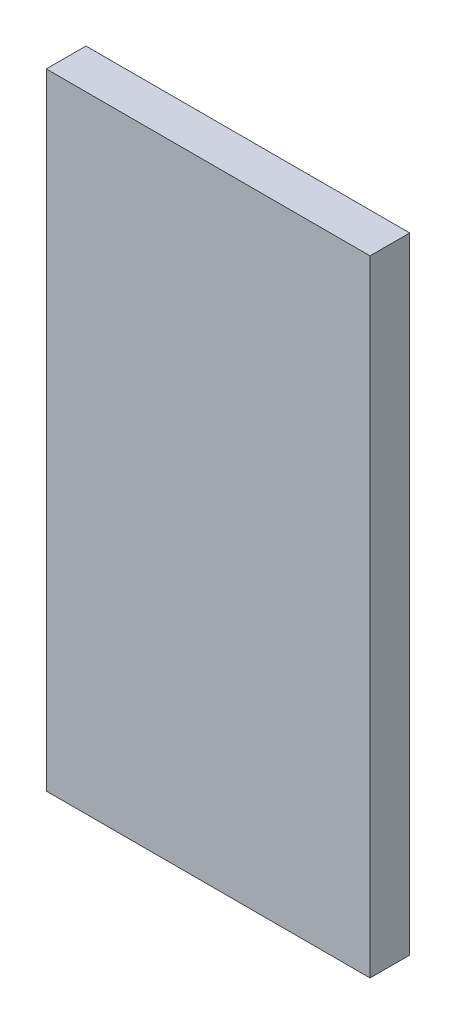
ISO-10303-21;
HEADER;
FILE_DESCRIPTION(('STEP AP214'),'2;1');
FILE_NAME('part.step','',(''),(''),'','','');
FILE_SCHEMA(('AUTOMOTIVE_DESIGN { 1 0 10303 214 1 1 1 1 }'));
ENDSEC;
DATA;
#1=APPLICATION_CONTEXT('core data for automotive mechanical design processes');
#2=APPLICATION_PROTOCOL_DEFINITION('international standard','automotive_design',2000,#1);
#3=PRODUCT_CONTEXT('',#1,'mechanical');
#4=PRODUCT('Part','Part','',(#3));
#5=PRODUCT_RELATED_PRODUCT_CATEGORY('part','',(#4));
#6=PRODUCT_DEFINITION_FORMATION('','',#4);
#7=PRODUCT_DEFINITION_CONTEXT('part definition',#1,'design');
#8=PRODUCT_DEFINITION('design','',#6,#7);
#9=PRODUCT_DEFINITION_SHAPE('','',#8);
#10=(LENGTH_UNIT() NAMED_UNIT(*) SI_UNIT(.MILLI.,.METRE.));
#11=(NAMED_UNIT(*) PLANE_ANGLE_UNIT() SI_UNIT($,.RADIAN.));
#12=(NAMED_UNIT(*) SI_UNIT($,.STERADIAN.) SOLID_ANGLE_UNIT());
#13=UNCERTAINTY_MEASURE_WITH_UNIT(LENGTH_MEASURE(1.E-05),#10,'distance_accuracy_value','');
#14=(GEOMETRIC_REPRESENTATION_CONTEXT(3) GLOBAL_UNCERTAINTY_ASSIGNED_CONTEXT((#13)) GLOBAL_UNIT_ASSIGNED_CONTEXT((#10,
#11,#12)) REPRESENTATION_CONTEXT('',''));
#15=CARTESIAN_POINT('',(0.,0.,0.));
#16=DIRECTION('',(0.,0.,1.));
#17=DIRECTION('',(1.,0.,0.));
#18=AXIS2_PLACEMENT_3D('',#15,#16,#17);
#19=CARTESIAN_POINT('',(-5.488,2.122,0.1));
#20=DIRECTION('',(0.,0.,1.));
#21=DIRECTION('',(1.,0.,0.));
#22=AXIS2_PLACEMENT_3D('',#19,#20,#21);
#23=PLANE('',#22);
#24=DIRECTION('',(0.,1.,0.));
#25=VECTOR('',#24,1.);
#26=CARTESIAN_POINT('',(-4.672,2.122,0.1));
#27=LINE('',#26,#25);
#28=CARTESIAN_POINT('',(-4.672,3.698,0.1));
#29=VERTEX_POINT('',#28);
#30=CARTESIAN_POINT('',(-4.672,2.122,0.1));
#31=VERTEX_POINT('',#30);
#32=EDGE_CURVE('E75',#29,#31,#27,.F.);
#33=ORIENTED_EDGE('',*,*,#32,.F.);
#34=DIRECTION('',(1.,0.,0.));
#35=VECTOR('',#34,1.);
#36=CARTESIAN_POINT('',(-5.488,3.698,0.1));
#37=LINE('',#36,#35);
#38=CARTESIAN_POINT('',(-5.488,3.698,0.1));
#39=VERTEX_POINT('',#38);
#40=EDGE_CURVE('E57',#39,#29,#37,.T.);
#41=ORIENTED_EDGE('',*,*,#40,.F.);
#42=DIRECTION('',(0.,1.,0.));
#43=VECTOR('',#42,1.);
#44=CARTESIAN_POINT('',(-5.488,2.122,0.1));
#45=LINE('',#44,#43);
#46=CARTESIAN_POINT('',(-5.488,2.122,0.1));
#47=VERTEX_POINT('',#46);
#48=EDGE_CURVE('E19',#39,#47,#45,.F.);
#49=ORIENTED_EDGE('',*,*,#48,.T.);
#50=DIRECTION('',(1.,0.,0.));
#51=VECTOR('',#50,1.);
#52=CARTESIAN_POINT('',(-5.488,2.122,0.1));
#53=LINE('',#52,#51);
#54=EDGE_CURVE('E54',#47,#31,#53,.T.);
#55=ORIENTED_EDGE('',*,*,#54,.T.);
#56=EDGE_LOOP('',(#33,#41,#49,#55));
#57=FACE_BOUND('',#56,.T.);
#58=ADVANCED_FACE('F16',(#57),#23,.T.);
#59=CARTESIAN_POINT('',(-5.488,2.122,0.));
#60=DIRECTION('',(1.,0.,0.));
#61=DIRECTION('',(0.,0.,-1.));
#62=AXIS2_PLACEMENT_3D('',#59,#60,#61);
#63=PLANE('',#62);
#64=DIRECTION('',(0.,0.,1.));
#65=VECTOR('',#64,1.);
#66=CARTESIAN_POINT('',(-5.488,3.698,0.));
#67=LINE('',#66,#65);
#68=CARTESIAN_POINT('',(-5.488,3.698,0.));
#69=VERTEX_POINT('',#68);
#70=EDGE_CURVE('E77',#69,#39,#67,.T.);
#71=ORIENTED_EDGE('',*,*,#70,.F.);
#72=DIRECTION('',(0.,1.,0.));
#73=VECTOR('',#72,1.);
#74=CARTESIAN_POINT('',(-5.488,2.122,0.));
#75=LINE('',#74,#73);
#76=CARTESIAN_POINT('',(-5.488,2.122,0.));
#77=VERTEX_POINT('',#76);
#78=EDGE_CURVE('E72',#69,#77,#75,.F.);
#79=ORIENTED_EDGE('',*,*,#78,.T.);
#80=DIRECTION('',(0.,0.,1.));
#81=VECTOR('',#80,1.);
#82=CARTESIAN_POINT('',(-5.488,2.122,0.));
#83=LINE('',#82,#81);
#84=EDGE_CURVE('E62',#77,#47,#83,.T.);
#85=ORIENTED_EDGE('',*,*,#84,.T.);
#86=ORIENTED_EDGE('',*,*,#48,.F.);
#87=EDGE_LOOP('',(#71,#79,#85,#86));
#88=FACE_BOUND('',#87,.T.);
#89=ADVANCED_FACE('F71',(#88),#63,.F.);
#90=CARTESIAN_POINT('',(-5.488,2.122,0.));
#91=DIRECTION('',(0.,1.,0.));
#92=DIRECTION('',(0.,0.,1.));
#93=AXIS2_PLACEMENT_3D('',#90,#91,#92);
#94=PLANE('',#93);
#95=ORIENTED_EDGE('',*,*,#54,.F.);
#96=ORIENTED_EDGE('',*,*,#84,.F.);
#97=DIRECTION('',(1.,0.,0.));
#98=VECTOR('',#97,1.);
#99=CARTESIAN_POINT('',(-5.488,2.122,0.));
#100=LINE('',#99,#98);
#101=CARTESIAN_POINT('',(-4.672,2.122,0.));
#102=VERTEX_POINT('',#101);
#103=EDGE_CURVE('E82',#77,#102,#100,.T.);
#104=ORIENTED_EDGE('',*,*,#103,.T.);
#105=DIRECTION('',(0.,0.,-1.));
#106=VECTOR('',#105,1.);
#107=CARTESIAN_POINT('',(-4.672,2.122,0.));
#108=LINE('',#107,#106);
#109=EDGE_CURVE('E68',#31,#102,#108,.T.);
#110=ORIENTED_EDGE('',*,*,#109,.F.);
#111=EDGE_LOOP('',(#95,#96,#104,#110));
#112=FACE_BOUND('',#111,.T.);
#113=ADVANCED_FACE('F65',(#112),#94,.F.);
#114=CARTESIAN_POINT('',(-4.672,2.122,0.));
#115=DIRECTION('',(1.,0.,0.));
#116=DIRECTION('',(0.,0.,-1.));
#117=AXIS2_PLACEMENT_3D('',#114,#115,#116);
#118=PLANE('',#117);
#119=DIRECTION('',(0.,0.,1.));
#120=VECTOR('',#119,1.);
#121=CARTESIAN_POINT('',(-4.672,3.698,0.));
#122=LINE('',#121,#120);
#123=CARTESIAN_POINT('',(-4.672,3.698,0.));
#124=VERTEX_POINT('',#123);
#125=EDGE_CURVE('E33',#29,#124,#122,.F.);
#126=ORIENTED_EDGE('',*,*,#125,.F.);
#127=ORIENTED_EDGE('',*,*,#32,.T.);
#128=ORIENTED_EDGE('',*,*,#109,.T.);
#129=DIRECTION('',(0.,1.,0.));
#130=VECTOR('',#129,1.);
#131=CARTESIAN_POINT('',(-4.672,2.122,0.));
#132=LINE('',#131,#130);
#133=EDGE_CURVE('E25',#102,#124,#132,.T.);
#134=ORIENTED_EDGE('',*,*,#133,.T.);
#135=EDGE_LOOP('',(#126,#127,#128,#134));
#136=FACE_BOUND('',#135,.T.);
#137=ADVANCED_FACE('F87',(#136),#118,.T.);
#138=CARTESIAN_POINT('',(-5.488,3.698,0.));
#139=DIRECTION('',(0.,1.,0.));
#140=DIRECTION('',(0.,0.,1.));
#141=AXIS2_PLACEMENT_3D('',#138,#139,#140);
#142=PLANE('',#141);
#143=ORIENTED_EDGE('',*,*,#40,.T.);
#144=ORIENTED_EDGE('',*,*,#125,.T.);
#145=DIRECTION('',(1.,0.,0.));
#146=VECTOR('',#145,1.);
#147=CARTESIAN_POINT('',(-5.488,3.698,0.));
#148=LINE('',#147,#146);
#149=EDGE_CURVE('E11',#124,#69,#148,.F.);
#150=ORIENTED_EDGE('',*,*,#149,.T.);
#151=ORIENTED_EDGE('',*,*,#70,.T.);
#152=EDGE_LOOP('',(#143,#144,#150,#151));
#153=FACE_BOUND('',#152,.T.);
#154=ADVANCED_FACE('F90',(#153),#142,.T.);
#155=CARTESIAN_POINT('',(-5.488,2.122,0.));
#156=DIRECTION('',(0.,0.,1.));
#157=DIRECTION('',(1.,0.,0.));
#158=AXIS2_PLACEMENT_3D('',#155,#156,#157);
#159=PLANE('',#158);
#160=ORIENTED_EDGE('',*,*,#133,.F.);
#161=ORIENTED_EDGE('',*,*,#103,.F.);
#162=ORIENTED_EDGE('',*,*,#78,.F.);
#163=ORIENTED_EDGE('',*,*,#149,.F.);
#164=EDGE_LOOP('',(#160,#161,#162,#163));
#165=FACE_BOUND('',#164,.T.);
#166=ADVANCED_FACE('F89',(#165),#159,.F.);
#167=CLOSED_SHELL('',(#58,#89,#113,#137,#154,#166));
#168=MANIFOLD_SOLID_BREP('B1',#167);
#169=ADVANCED_BREP_SHAPE_REPRESENTATION('',(#18,#168),#14);
#170=SHAPE_DEFINITION_REPRESENTATION(#9,#169);
ENDSEC;
END-ISO-10303-21;
